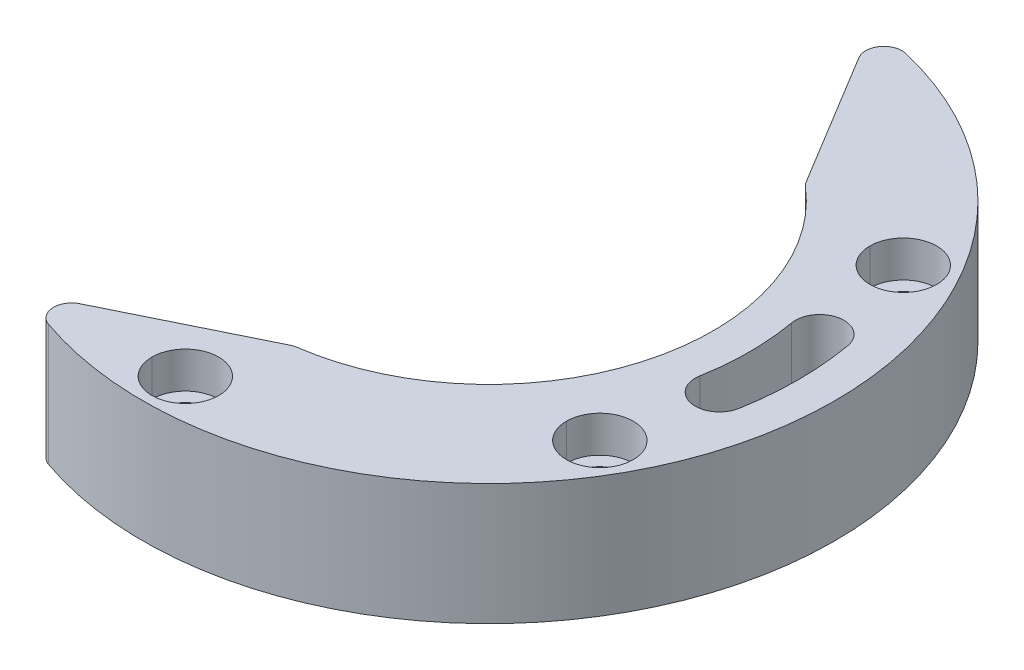
ISO-10303-21;
HEADER;
FILE_DESCRIPTION(('STEP AP214'),'2;1');
FILE_NAME('part.step','',(''),(''),'','','');
FILE_SCHEMA(('AUTOMOTIVE_DESIGN { 1 0 10303 214 1 1 1 1 }'));
ENDSEC;
DATA;
#1=APPLICATION_CONTEXT('core data for automotive mechanical design processes');
#2=APPLICATION_PROTOCOL_DEFINITION('international standard','automotive_design',2000,#1);
#3=PRODUCT_CONTEXT('',#1,'mechanical');
#4=PRODUCT('Part','Part','',(#3));
#5=PRODUCT_RELATED_PRODUCT_CATEGORY('part','',(#4));
#6=PRODUCT_DEFINITION_FORMATION('','',#4);
#7=PRODUCT_DEFINITION_CONTEXT('part definition',#1,'design');
#8=PRODUCT_DEFINITION('design','',#6,#7);
#9=PRODUCT_DEFINITION_SHAPE('','',#8);
#10=(LENGTH_UNIT() NAMED_UNIT(*) SI_UNIT(.MILLI.,.METRE.));
#11=(NAMED_UNIT(*) PLANE_ANGLE_UNIT() SI_UNIT($,.RADIAN.));
#12=(NAMED_UNIT(*) SI_UNIT($,.STERADIAN.) SOLID_ANGLE_UNIT());
#13=UNCERTAINTY_MEASURE_WITH_UNIT(LENGTH_MEASURE(1.E-05),#10,'distance_accuracy_value','');
#14=(GEOMETRIC_REPRESENTATION_CONTEXT(3) GLOBAL_UNCERTAINTY_ASSIGNED_CONTEXT((#13)) GLOBAL_UNIT_ASSIGNED_CONTEXT((#10,
#11,#12)) REPRESENTATION_CONTEXT('',''));
#15=CARTESIAN_POINT('',(0.,0.,0.));
#16=DIRECTION('',(0.,0.,1.));
#17=DIRECTION('',(1.,0.,0.));
#18=AXIS2_PLACEMENT_3D('',#15,#16,#17);
#19=CARTESIAN_POINT('',(23.1345391558331,18.036,-4.1283287232515));
#20=DIRECTION('',(0.,-1.,0.));
#21=DIRECTION('',(-0.258819045102522,0.,-0.965925826289068));
#22=AXIS2_PLACEMENT_3D('',#19,#20,#21);
#23=CYLINDRICAL_SURFACE('',#22,2.);
#24=CARTESIAN_POINT('',(23.1345391558331,5.,-4.1283287232515));
#25=DIRECTION('',(0.,1.,0.));
#26=DIRECTION('',(0.984448474716304,0.,-0.175673562691552));
#27=AXIS2_PLACEMENT_3D('',#24,#25,#26);
#28=CIRCLE('',#27,2.);
#29=CARTESIAN_POINT('',(25.1034361052657,5.,-4.4796758486346));
#30=VERTEX_POINT('',#29);
#31=CARTESIAN_POINT('',(21.1656422064005,5.,-3.77698159786839));
#32=VERTEX_POINT('',#31);
#33=EDGE_CURVE('E10',#30,#32,#28,.T.);
#34=ORIENTED_EDGE('',*,*,#33,.T.);
#35=DIRECTION('',(0.,-1.,0.));
#36=VECTOR('',#35,1.);
#37=CARTESIAN_POINT('',(21.1656422064005,5.,-3.77698159786839));
#38=LINE('',#37,#36);
#39=CARTESIAN_POINT('',(21.1656422064005,-5.,-3.77698159786839));
#40=VERTEX_POINT('',#39);
#41=EDGE_CURVE('E24',#32,#40,#38,.T.);
#42=ORIENTED_EDGE('',*,*,#41,.T.);
#43=CARTESIAN_POINT('',(23.1345391558331,-5.,-4.1283287232515));
#44=DIRECTION('',(0.,-1.,0.));
#45=DIRECTION('',(-0.984448474716304,0.,0.175673562691554));
#46=AXIS2_PLACEMENT_3D('',#43,#44,#45);
#47=CIRCLE('',#46,2.);
#48=CARTESIAN_POINT('',(25.1034361052657,-5.,-4.4796758486346));
#49=VERTEX_POINT('',#48);
#50=EDGE_CURVE('E429',#40,#49,#47,.T.);
#51=ORIENTED_EDGE('',*,*,#50,.T.);
#52=DIRECTION('',(0.,-1.,0.));
#53=VECTOR('',#52,1.);
#54=CARTESIAN_POINT('',(25.1034361052657,5.,-4.4796758486346));
#55=LINE('',#54,#53);
#56=EDGE_CURVE('E425',#30,#49,#55,.T.);
#57=ORIENTED_EDGE('',*,*,#56,.F.);
#58=EDGE_LOOP('',(#34,#42,#51,#57));
#59=FACE_BOUND('',#58,.T.);
#60=ADVANCED_FACE('F16',(#59),#23,.F.);
#61=CARTESIAN_POINT('',(0.,5.,0.));
#62=DIRECTION('',(0.,1.,0.));
#63=DIRECTION('',(-1.,0.,0.));
#64=AXIS2_PLACEMENT_3D('',#61,#62,#63);
#65=CYLINDRICAL_SURFACE('',#64,21.5);
#66=CARTESIAN_POINT('',(0.,-5.,0.));
#67=DIRECTION('',(0.,1.,0.));
#68=DIRECTION('',(0.984448474716304,0.,0.175673562691553));
#69=AXIS2_PLACEMENT_3D('',#66,#67,#68);
#70=CIRCLE('',#69,21.5);
#71=CARTESIAN_POINT('',(21.1656422064005,-5.,3.77698159786839));
#72=VERTEX_POINT('',#71);
#73=EDGE_CURVE('E422',#72,#40,#70,.T.);
#74=ORIENTED_EDGE('',*,*,#73,.T.);
#75=ORIENTED_EDGE('',*,*,#41,.F.);
#76=CARTESIAN_POINT('',(0.,5.,0.));
#77=DIRECTION('',(0.,1.,0.));
#78=DIRECTION('',(0.984448474716304,0.,0.175673562691553));
#79=AXIS2_PLACEMENT_3D('',#76,#77,#78);
#80=CIRCLE('',#79,21.5);
#81=CARTESIAN_POINT('',(21.1656422064005,5.,3.77698159786839));
#82=VERTEX_POINT('',#81);
#83=EDGE_CURVE('E418',#82,#32,#80,.T.);
#84=ORIENTED_EDGE('',*,*,#83,.F.);
#85=DIRECTION('',(0.,-1.,0.));
#86=VECTOR('',#85,1.);
#87=CARTESIAN_POINT('',(21.1656422064005,5.,3.77698159786839));
#88=LINE('',#87,#86);
#89=EDGE_CURVE('E415',#82,#72,#88,.T.);
#90=ORIENTED_EDGE('',*,*,#89,.T.);
#91=EDGE_LOOP('',(#74,#75,#84,#90));
#92=FACE_BOUND('',#91,.T.);
#93=ADVANCED_FACE('F452',(#92),#65,.T.);
#94=CARTESIAN_POINT('',(23.1345391558331,18.036,4.1283287232515));
#95=DIRECTION('',(0.,-1.,0.));
#96=DIRECTION('',(-0.25881904510252,0.,0.965925826289069));
#97=AXIS2_PLACEMENT_3D('',#94,#95,#96);
#98=CYLINDRICAL_SURFACE('',#97,2.);
#99=CARTESIAN_POINT('',(23.1345391558331,5.,4.1283287232515));
#100=DIRECTION('',(0.,1.,0.));
#101=DIRECTION('',(-0.984448474716304,0.,-0.175673562691552));
#102=AXIS2_PLACEMENT_3D('',#99,#100,#101);
#103=CIRCLE('',#102,2.);
#104=CARTESIAN_POINT('',(25.1034361052657,5.,4.47967584863461));
#105=VERTEX_POINT('',#104);
#106=EDGE_CURVE('E412',#82,#105,#103,.T.);
#107=ORIENTED_EDGE('',*,*,#106,.T.);
#108=DIRECTION('',(0.,-1.,0.));
#109=VECTOR('',#108,1.);
#110=CARTESIAN_POINT('',(25.1034361052657,5.,4.47967584863461));
#111=LINE('',#110,#109);
#112=CARTESIAN_POINT('',(25.1034361052657,-5.,4.47967584863461));
#113=VERTEX_POINT('',#112);
#114=EDGE_CURVE('E409',#105,#113,#111,.T.);
#115=ORIENTED_EDGE('',*,*,#114,.T.);
#116=CARTESIAN_POINT('',(23.1345391558331,-5.,4.1283287232515));
#117=DIRECTION('',(0.,-1.,0.));
#118=DIRECTION('',(0.984448474716303,0.,0.175673562691555));
#119=AXIS2_PLACEMENT_3D('',#116,#117,#118);
#120=CIRCLE('',#119,2.);
#121=EDGE_CURVE('E405',#113,#72,#120,.T.);
#122=ORIENTED_EDGE('',*,*,#121,.T.);
#123=ORIENTED_EDGE('',*,*,#89,.F.);
#124=EDGE_LOOP('',(#107,#115,#122,#123));
#125=FACE_BOUND('',#124,.T.);
#126=ADVANCED_FACE('F447',(#125),#98,.F.);
#127=CARTESIAN_POINT('',(0.,5.,0.));
#128=DIRECTION('',(0.,1.,0.));
#129=DIRECTION('',(-1.,0.,0.));
#130=AXIS2_PLACEMENT_3D('',#127,#128,#129);
#131=CYLINDRICAL_SURFACE('',#130,25.5);
#132=CARTESIAN_POINT('',(0.,5.,0.));
#133=DIRECTION('',(0.,1.,0.));
#134=DIRECTION('',(0.984448474716304,0.,0.175673562691553));
#135=AXIS2_PLACEMENT_3D('',#132,#133,#134);
#136=CIRCLE('',#135,25.5);
#137=EDGE_CURVE('E401',#105,#30,#136,.T.);
#138=ORIENTED_EDGE('',*,*,#137,.T.);
#139=ORIENTED_EDGE('',*,*,#56,.T.);
#140=CARTESIAN_POINT('',(0.,-5.,0.));
#141=DIRECTION('',(0.,1.,0.));
#142=DIRECTION('',(0.984448474716304,0.,0.175673562691553));
#143=AXIS2_PLACEMENT_3D('',#140,#141,#142);
#144=CIRCLE('',#143,25.5);
#145=EDGE_CURVE('E397',#113,#49,#144,.T.);
#146=ORIENTED_EDGE('',*,*,#145,.F.);
#147=ORIENTED_EDGE('',*,*,#114,.F.);
#148=EDGE_LOOP('',(#138,#139,#146,#147));
#149=FACE_BOUND('',#148,.T.);
#150=ADVANCED_FACE('F439',(#149),#131,.F.);
#151=CARTESIAN_POINT('',(21.650635094611,-5.,-12.5));
#152=DIRECTION('',(0.,-1.,0.));
#153=DIRECTION('',(1.,0.,0.));
#154=AXIS2_PLACEMENT_3D('',#151,#152,#153);
#155=CYLINDRICAL_SURFACE('',#154,1.6);
#156=DIRECTION('',(0.,1.,0.));
#157=VECTOR('',#156,1.);
#158=CARTESIAN_POINT('',(20.050635094611,-5.,-12.5));
#159=LINE('',#158,#157);
#160=CARTESIAN_POINT('',(20.050635094611,-5.,-12.5));
#161=VERTEX_POINT('',#160);
#162=CARTESIAN_POINT('',(20.050635094611,2.,-12.5));
#163=VERTEX_POINT('',#162);
#164=EDGE_CURVE('E393',#161,#163,#159,.T.);
#165=ORIENTED_EDGE('',*,*,#164,.F.);
#166=CARTESIAN_POINT('',(21.650635094611,-5.,-12.5));
#167=DIRECTION('',(0.,-1.,0.));
#168=DIRECTION('',(-1.,0.,0.));
#169=AXIS2_PLACEMENT_3D('',#166,#167,#168);
#170=CIRCLE('',#169,1.6);
#171=CARTESIAN_POINT('',(23.250635094611,-5.,-12.5));
#172=VERTEX_POINT('',#171);
#173=EDGE_CURVE('E390',#161,#172,#170,.T.);
#174=ORIENTED_EDGE('',*,*,#173,.T.);
#175=DIRECTION('',(0.,1.,0.));
#176=VECTOR('',#175,1.);
#177=CARTESIAN_POINT('',(23.250635094611,-5.,-12.5));
#178=LINE('',#177,#176);
#179=CARTESIAN_POINT('',(23.250635094611,2.,-12.5));
#180=VERTEX_POINT('',#179);
#181=EDGE_CURVE('E387',#172,#180,#178,.T.);
#182=ORIENTED_EDGE('',*,*,#181,.T.);
#183=CARTESIAN_POINT('',(21.650635094611,2.,-12.5));
#184=DIRECTION('',(0.,1.,0.));
#185=DIRECTION('',(1.,0.,0.));
#186=AXIS2_PLACEMENT_3D('',#183,#184,#185);
#187=CIRCLE('',#186,1.6);
#188=EDGE_CURVE('E384',#180,#163,#187,.T.);
#189=ORIENTED_EDGE('',*,*,#188,.T.);
#190=EDGE_LOOP('',(#165,#174,#182,#189));
#191=FACE_BOUND('',#190,.T.);
#192=ADVANCED_FACE('F463',(#191),#155,.F.);
#193=CARTESIAN_POINT('',(21.650635094611,5.,-12.5));
#194=DIRECTION('',(0.,1.,0.));
#195=DIRECTION('',(-1.,0.,0.));
#196=AXIS2_PLACEMENT_3D('',#193,#194,#195);
#197=CYLINDRICAL_SURFACE('',#196,2.75);
#198=CARTESIAN_POINT('',(21.650635094611,2.,-12.5));
#199=DIRECTION('',(0.,1.,0.));
#200=DIRECTION('',(1.,0.,0.));
#201=AXIS2_PLACEMENT_3D('',#198,#199,#200);
#202=CIRCLE('',#201,2.75);
#203=CARTESIAN_POINT('',(24.400635094611,2.,-12.5));
#204=VERTEX_POINT('',#203);
#205=CARTESIAN_POINT('',(18.900635094611,2.,-12.5));
#206=VERTEX_POINT('',#205);
#207=EDGE_CURVE('E380',#204,#206,#202,.T.);
#208=ORIENTED_EDGE('',*,*,#207,.F.);
#209=DIRECTION('',(0.,-1.,0.));
#210=VECTOR('',#209,1.);
#211=CARTESIAN_POINT('',(24.400635094611,5.,-12.5));
#212=LINE('',#211,#210);
#213=CARTESIAN_POINT('',(24.400635094611,5.,-12.5));
#214=VERTEX_POINT('',#213);
#215=EDGE_CURVE('E376',#214,#204,#212,.T.);
#216=ORIENTED_EDGE('',*,*,#215,.F.);
#217=CARTESIAN_POINT('',(21.650635094611,5.,-12.5));
#218=DIRECTION('',(0.,1.,0.));
#219=DIRECTION('',(1.,0.,0.));
#220=AXIS2_PLACEMENT_3D('',#217,#218,#219);
#221=CIRCLE('',#220,2.75);
#222=CARTESIAN_POINT('',(18.900635094611,5.,-12.5));
#223=VERTEX_POINT('',#222);
#224=EDGE_CURVE('E373',#214,#223,#221,.T.);
#225=ORIENTED_EDGE('',*,*,#224,.T.);
#226=DIRECTION('',(0.,-1.,0.));
#227=VECTOR('',#226,1.);
#228=CARTESIAN_POINT('',(18.900635094611,5.,-12.5));
#229=LINE('',#228,#227);
#230=EDGE_CURVE('E370',#223,#206,#229,.T.);
#231=ORIENTED_EDGE('',*,*,#230,.T.);
#232=EDGE_LOOP('',(#208,#216,#225,#231));
#233=FACE_BOUND('',#232,.T.);
#234=ADVANCED_FACE('F466',(#233),#197,.F.);
#235=CARTESIAN_POINT('',(21.650635094611,5.,-12.5));
#236=DIRECTION('',(0.,1.,0.));
#237=DIRECTION('',(-1.,0.,0.));
#238=AXIS2_PLACEMENT_3D('',#235,#236,#237);
#239=CYLINDRICAL_SURFACE('',#238,2.75);
#240=CARTESIAN_POINT('',(21.650635094611,5.,-12.5));
#241=DIRECTION('',(0.,1.,0.));
#242=DIRECTION('',(-1.,0.,0.));
#243=AXIS2_PLACEMENT_3D('',#240,#241,#242);
#244=CIRCLE('',#243,2.75);
#245=EDGE_CURVE('E366',#223,#214,#244,.T.);
#246=ORIENTED_EDGE('',*,*,#245,.T.);
#247=ORIENTED_EDGE('',*,*,#215,.T.);
#248=CARTESIAN_POINT('',(21.650635094611,2.,-12.5));
#249=DIRECTION('',(0.,1.,0.));
#250=DIRECTION('',(-1.,0.,0.));
#251=AXIS2_PLACEMENT_3D('',#248,#249,#250);
#252=CIRCLE('',#251,2.75);
#253=EDGE_CURVE('E362',#206,#204,#252,.T.);
#254=ORIENTED_EDGE('',*,*,#253,.F.);
#255=ORIENTED_EDGE('',*,*,#230,.F.);
#256=EDGE_LOOP('',(#246,#247,#254,#255));
#257=FACE_BOUND('',#256,.T.);
#258=ADVANCED_FACE('F470',(#257),#239,.F.);
#259=CARTESIAN_POINT('',(0.,2.,0.));
#260=DIRECTION('',(0.,1.,0.));
#261=DIRECTION('',(-1.,0.,0.));
#262=AXIS2_PLACEMENT_3D('',#259,#260,#261);
#263=PLANE('',#262);
#264=ORIENTED_EDGE('',*,*,#188,.F.);
#265=CARTESIAN_POINT('',(21.650635094611,2.,-12.5));
#266=DIRECTION('',(0.,1.,0.));
#267=DIRECTION('',(-1.,0.,0.));
#268=AXIS2_PLACEMENT_3D('',#265,#266,#267);
#269=CIRCLE('',#268,1.6);
#270=EDGE_CURVE('E358',#163,#180,#269,.T.);
#271=ORIENTED_EDGE('',*,*,#270,.F.);
#272=EDGE_LOOP('',(#264,#271));
#273=FACE_BOUND('',#272,.T.);
#274=ORIENTED_EDGE('',*,*,#207,.T.);
#275=ORIENTED_EDGE('',*,*,#253,.T.);
#276=EDGE_LOOP('',(#274,#275));
#277=FACE_BOUND('',#276,.T.);
#278=ADVANCED_FACE('F474',(#273,#277),#263,.T.);
#279=CARTESIAN_POINT('',(21.650635094611,-5.,-12.5));
#280=DIRECTION('',(0.,-1.,0.));
#281=DIRECTION('',(1.,0.,0.));
#282=AXIS2_PLACEMENT_3D('',#279,#280,#281);
#283=CYLINDRICAL_SURFACE('',#282,1.6);
#284=ORIENTED_EDGE('',*,*,#181,.F.);
#285=CARTESIAN_POINT('',(21.650635094611,-5.,-12.5));
#286=DIRECTION('',(0.,-1.,0.));
#287=DIRECTION('',(1.,0.,0.));
#288=AXIS2_PLACEMENT_3D('',#285,#286,#287);
#289=CIRCLE('',#288,1.6);
#290=EDGE_CURVE('E354',#172,#161,#289,.T.);
#291=ORIENTED_EDGE('',*,*,#290,.T.);
#292=ORIENTED_EDGE('',*,*,#164,.T.);
#293=ORIENTED_EDGE('',*,*,#270,.T.);
#294=EDGE_LOOP('',(#284,#291,#292,#293));
#295=FACE_BOUND('',#294,.T.);
#296=ADVANCED_FACE('F478',(#295),#283,.F.);
#297=CARTESIAN_POINT('',(21.650635094611,-5.,12.5));
#298=DIRECTION('',(0.,-1.,0.));
#299=DIRECTION('',(1.,0.,0.));
#300=AXIS2_PLACEMENT_3D('',#297,#298,#299);
#301=CYLINDRICAL_SURFACE('',#300,1.6);
#302=DIRECTION('',(0.,1.,0.));
#303=VECTOR('',#302,1.);
#304=CARTESIAN_POINT('',(20.050635094611,-5.,12.5));
#305=LINE('',#304,#303);
#306=CARTESIAN_POINT('',(20.050635094611,-5.,12.5));
#307=VERTEX_POINT('',#306);
#308=CARTESIAN_POINT('',(20.050635094611,2.,12.5));
#309=VERTEX_POINT('',#308);
#310=EDGE_CURVE('E350',#307,#309,#305,.T.);
#311=ORIENTED_EDGE('',*,*,#310,.F.);
#312=CARTESIAN_POINT('',(21.650635094611,-5.,12.5));
#313=DIRECTION('',(0.,-1.,0.));
#314=DIRECTION('',(-1.,0.,0.));
#315=AXIS2_PLACEMENT_3D('',#312,#313,#314);
#316=CIRCLE('',#315,1.6);
#317=CARTESIAN_POINT('',(23.250635094611,-5.,12.5));
#318=VERTEX_POINT('',#317);
#319=EDGE_CURVE('E347',#307,#318,#316,.T.);
#320=ORIENTED_EDGE('',*,*,#319,.T.);
#321=DIRECTION('',(0.,1.,0.));
#322=VECTOR('',#321,1.);
#323=CARTESIAN_POINT('',(23.250635094611,-5.,12.5));
#324=LINE('',#323,#322);
#325=CARTESIAN_POINT('',(23.250635094611,2.,12.5));
#326=VERTEX_POINT('',#325);
#327=EDGE_CURVE('E344',#318,#326,#324,.T.);
#328=ORIENTED_EDGE('',*,*,#327,.T.);
#329=CARTESIAN_POINT('',(21.650635094611,2.,12.5));
#330=DIRECTION('',(0.,1.,0.));
#331=DIRECTION('',(1.,0.,0.));
#332=AXIS2_PLACEMENT_3D('',#329,#330,#331);
#333=CIRCLE('',#332,1.6);
#334=EDGE_CURVE('E341',#326,#309,#333,.T.);
#335=ORIENTED_EDGE('',*,*,#334,.T.);
#336=EDGE_LOOP('',(#311,#320,#328,#335));
#337=FACE_BOUND('',#336,.T.);
#338=ADVANCED_FACE('F482',(#337),#301,.F.);
#339=CARTESIAN_POINT('',(21.650635094611,5.,12.5));
#340=DIRECTION('',(0.,1.,0.));
#341=DIRECTION('',(-1.,0.,0.));
#342=AXIS2_PLACEMENT_3D('',#339,#340,#341);
#343=CYLINDRICAL_SURFACE('',#342,2.75);
#344=CARTESIAN_POINT('',(21.650635094611,2.,12.5));
#345=DIRECTION('',(0.,1.,0.));
#346=DIRECTION('',(1.,0.,0.));
#347=AXIS2_PLACEMENT_3D('',#344,#345,#346);
#348=CIRCLE('',#347,2.75);
#349=CARTESIAN_POINT('',(24.400635094611,2.,12.5));
#350=VERTEX_POINT('',#349);
#351=CARTESIAN_POINT('',(18.900635094611,2.,12.5));
#352=VERTEX_POINT('',#351);
#353=EDGE_CURVE('E337',#350,#352,#348,.T.);
#354=ORIENTED_EDGE('',*,*,#353,.F.);
#355=DIRECTION('',(0.,-1.,0.));
#356=VECTOR('',#355,1.);
#357=CARTESIAN_POINT('',(24.400635094611,5.,12.5));
#358=LINE('',#357,#356);
#359=CARTESIAN_POINT('',(24.400635094611,5.,12.5));
#360=VERTEX_POINT('',#359);
#361=EDGE_CURVE('E333',#360,#350,#358,.T.);
#362=ORIENTED_EDGE('',*,*,#361,.F.);
#363=CARTESIAN_POINT('',(21.650635094611,5.,12.5));
#364=DIRECTION('',(0.,1.,0.));
#365=DIRECTION('',(1.,0.,0.));
#366=AXIS2_PLACEMENT_3D('',#363,#364,#365);
#367=CIRCLE('',#366,2.75);
#368=CARTESIAN_POINT('',(18.900635094611,5.,12.5));
#369=VERTEX_POINT('',#368);
#370=EDGE_CURVE('E330',#360,#369,#367,.T.);
#371=ORIENTED_EDGE('',*,*,#370,.T.);
#372=DIRECTION('',(0.,-1.,0.));
#373=VECTOR('',#372,1.);
#374=CARTESIAN_POINT('',(18.900635094611,5.,12.5));
#375=LINE('',#374,#373);
#376=EDGE_CURVE('E327',#369,#352,#375,.T.);
#377=ORIENTED_EDGE('',*,*,#376,.T.);
#378=EDGE_LOOP('',(#354,#362,#371,#377));
#379=FACE_BOUND('',#378,.T.);
#380=ADVANCED_FACE('F486',(#379),#343,.F.);
#381=CARTESIAN_POINT('',(21.650635094611,5.,12.5));
#382=DIRECTION('',(0.,1.,0.));
#383=DIRECTION('',(-1.,0.,0.));
#384=AXIS2_PLACEMENT_3D('',#381,#382,#383);
#385=CYLINDRICAL_SURFACE('',#384,2.75);
#386=CARTESIAN_POINT('',(21.650635094611,5.,12.5));
#387=DIRECTION('',(0.,1.,0.));
#388=DIRECTION('',(-1.,0.,0.));
#389=AXIS2_PLACEMENT_3D('',#386,#387,#388);
#390=CIRCLE('',#389,2.75);
#391=EDGE_CURVE('E323',#369,#360,#390,.T.);
#392=ORIENTED_EDGE('',*,*,#391,.T.);
#393=ORIENTED_EDGE('',*,*,#361,.T.);
#394=CARTESIAN_POINT('',(21.650635094611,2.,12.5));
#395=DIRECTION('',(0.,1.,0.));
#396=DIRECTION('',(-1.,0.,0.));
#397=AXIS2_PLACEMENT_3D('',#394,#395,#396);
#398=CIRCLE('',#397,2.75);
#399=EDGE_CURVE('E319',#352,#350,#398,.T.);
#400=ORIENTED_EDGE('',*,*,#399,.F.);
#401=ORIENTED_EDGE('',*,*,#376,.F.);
#402=EDGE_LOOP('',(#392,#393,#400,#401));
#403=FACE_BOUND('',#402,.T.);
#404=ADVANCED_FACE('F490',(#403),#385,.F.);
#405=CARTESIAN_POINT('',(0.,2.,0.));
#406=DIRECTION('',(0.,1.,0.));
#407=DIRECTION('',(-1.,0.,0.));
#408=AXIS2_PLACEMENT_3D('',#405,#406,#407);
#409=PLANE('',#408);
#410=ORIENTED_EDGE('',*,*,#334,.F.);
#411=CARTESIAN_POINT('',(21.650635094611,2.,12.5));
#412=DIRECTION('',(0.,1.,0.));
#413=DIRECTION('',(-1.,0.,0.));
#414=AXIS2_PLACEMENT_3D('',#411,#412,#413);
#415=CIRCLE('',#414,1.6);
#416=EDGE_CURVE('E315',#309,#326,#415,.T.);
#417=ORIENTED_EDGE('',*,*,#416,.F.);
#418=EDGE_LOOP('',(#410,#417));
#419=FACE_BOUND('',#418,.T.);
#420=ORIENTED_EDGE('',*,*,#353,.T.);
#421=ORIENTED_EDGE('',*,*,#399,.T.);
#422=EDGE_LOOP('',(#420,#421));
#423=FACE_BOUND('',#422,.T.);
#424=ADVANCED_FACE('F494',(#419,#423),#409,.T.);
#425=CARTESIAN_POINT('',(21.650635094611,-5.,12.5));
#426=DIRECTION('',(0.,-1.,0.));
#427=DIRECTION('',(1.,0.,0.));
#428=AXIS2_PLACEMENT_3D('',#425,#426,#427);
#429=CYLINDRICAL_SURFACE('',#428,1.6);
#430=ORIENTED_EDGE('',*,*,#327,.F.);
#431=CARTESIAN_POINT('',(21.650635094611,-5.,12.5));
#432=DIRECTION('',(0.,-1.,0.));
#433=DIRECTION('',(1.,0.,0.));
#434=AXIS2_PLACEMENT_3D('',#431,#432,#433);
#435=CIRCLE('',#434,1.6);
#436=EDGE_CURVE('E311',#318,#307,#435,.T.);
#437=ORIENTED_EDGE('',*,*,#436,.T.);
#438=ORIENTED_EDGE('',*,*,#310,.T.);
#439=ORIENTED_EDGE('',*,*,#416,.T.);
#440=EDGE_LOOP('',(#430,#437,#438,#439));
#441=FACE_BOUND('',#440,.T.);
#442=ADVANCED_FACE('F498',(#441),#429,.F.);
#443=CARTESIAN_POINT('',(0.,-5.,25.));
#444=DIRECTION('',(0.,-1.,0.));
#445=DIRECTION('',(1.,0.,0.));
#446=AXIS2_PLACEMENT_3D('',#443,#444,#445);
#447=CYLINDRICAL_SURFACE('',#446,1.6);
#448=DIRECTION('',(0.,1.,0.));
#449=VECTOR('',#448,1.);
#450=CARTESIAN_POINT('',(-1.6,-5.,25.));
#451=LINE('',#450,#449);
#452=CARTESIAN_POINT('',(-1.6,-5.,25.));
#453=VERTEX_POINT('',#452);
#454=CARTESIAN_POINT('',(-1.6,2.,25.));
#455=VERTEX_POINT('',#454);
#456=EDGE_CURVE('E307',#453,#455,#451,.T.);
#457=ORIENTED_EDGE('',*,*,#456,.F.);
#458=CARTESIAN_POINT('',(0.,-5.,25.));
#459=DIRECTION('',(0.,-1.,0.));
#460=DIRECTION('',(-1.,0.,0.));
#461=AXIS2_PLACEMENT_3D('',#458,#459,#460);
#462=CIRCLE('',#461,1.6);
#463=CARTESIAN_POINT('',(1.6,-5.,25.));
#464=VERTEX_POINT('',#463);
#465=EDGE_CURVE('E304',#453,#464,#462,.T.);
#466=ORIENTED_EDGE('',*,*,#465,.T.);
#467=DIRECTION('',(0.,1.,0.));
#468=VECTOR('',#467,1.);
#469=CARTESIAN_POINT('',(1.6,-5.,25.));
#470=LINE('',#469,#468);
#471=CARTESIAN_POINT('',(1.6,2.,25.));
#472=VERTEX_POINT('',#471);
#473=EDGE_CURVE('E301',#464,#472,#470,.T.);
#474=ORIENTED_EDGE('',*,*,#473,.T.);
#475=CARTESIAN_POINT('',(0.,2.,25.));
#476=DIRECTION('',(0.,1.,0.));
#477=DIRECTION('',(1.,0.,0.));
#478=AXIS2_PLACEMENT_3D('',#475,#476,#477);
#479=CIRCLE('',#478,1.6);
#480=EDGE_CURVE('E298',#472,#455,#479,.T.);
#481=ORIENTED_EDGE('',*,*,#480,.T.);
#482=EDGE_LOOP('',(#457,#466,#474,#481));
#483=FACE_BOUND('',#482,.T.);
#484=ADVANCED_FACE('F502',(#483),#447,.F.);
#485=CARTESIAN_POINT('',(0.,5.,25.));
#486=DIRECTION('',(0.,1.,0.));
#487=DIRECTION('',(-1.,0.,0.));
#488=AXIS2_PLACEMENT_3D('',#485,#486,#487);
#489=CYLINDRICAL_SURFACE('',#488,2.75);
#490=CARTESIAN_POINT('',(0.,2.,25.));
#491=DIRECTION('',(0.,1.,0.));
#492=DIRECTION('',(1.,0.,0.));
#493=AXIS2_PLACEMENT_3D('',#490,#491,#492);
#494=CIRCLE('',#493,2.75);
#495=CARTESIAN_POINT('',(2.75,2.,25.));
#496=VERTEX_POINT('',#495);
#497=CARTESIAN_POINT('',(-2.75,2.,25.));
#498=VERTEX_POINT('',#497);
#499=EDGE_CURVE('E294',#496,#498,#494,.T.);
#500=ORIENTED_EDGE('',*,*,#499,.F.);
#501=DIRECTION('',(0.,-1.,0.));
#502=VECTOR('',#501,1.);
#503=CARTESIAN_POINT('',(2.75,5.,25.));
#504=LINE('',#503,#502);
#505=CARTESIAN_POINT('',(2.75,5.,25.));
#506=VERTEX_POINT('',#505);
#507=EDGE_CURVE('E290',#506,#496,#504,.T.);
#508=ORIENTED_EDGE('',*,*,#507,.F.);
#509=CARTESIAN_POINT('',(0.,5.,25.));
#510=DIRECTION('',(0.,1.,0.));
#511=DIRECTION('',(1.,0.,0.));
#512=AXIS2_PLACEMENT_3D('',#509,#510,#511);
#513=CIRCLE('',#512,2.75);
#514=CARTESIAN_POINT('',(-2.75,5.,25.));
#515=VERTEX_POINT('',#514);
#516=EDGE_CURVE('E287',#506,#515,#513,.T.);
#517=ORIENTED_EDGE('',*,*,#516,.T.);
#518=DIRECTION('',(0.,-1.,0.));
#519=VECTOR('',#518,1.);
#520=CARTESIAN_POINT('',(-2.75,5.,25.));
#521=LINE('',#520,#519);
#522=EDGE_CURVE('E284',#515,#498,#521,.T.);
#523=ORIENTED_EDGE('',*,*,#522,.T.);
#524=EDGE_LOOP('',(#500,#508,#517,#523));
#525=FACE_BOUND('',#524,.T.);
#526=ADVANCED_FACE('F506',(#525),#489,.F.);
#527=CARTESIAN_POINT('',(0.,5.,25.));
#528=DIRECTION('',(0.,1.,0.));
#529=DIRECTION('',(-1.,0.,0.));
#530=AXIS2_PLACEMENT_3D('',#527,#528,#529);
#531=CYLINDRICAL_SURFACE('',#530,2.75);
#532=CARTESIAN_POINT('',(0.,5.,25.));
#533=DIRECTION('',(0.,1.,0.));
#534=DIRECTION('',(-1.,0.,0.));
#535=AXIS2_PLACEMENT_3D('',#532,#533,#534);
#536=CIRCLE('',#535,2.75);
#537=EDGE_CURVE('E280',#515,#506,#536,.T.);
#538=ORIENTED_EDGE('',*,*,#537,.T.);
#539=ORIENTED_EDGE('',*,*,#507,.T.);
#540=CARTESIAN_POINT('',(0.,2.,25.));
#541=DIRECTION('',(0.,1.,0.));
#542=DIRECTION('',(-1.,0.,0.));
#543=AXIS2_PLACEMENT_3D('',#540,#541,#542);
#544=CIRCLE('',#543,2.75);
#545=EDGE_CURVE('E276',#498,#496,#544,.T.);
#546=ORIENTED_EDGE('',*,*,#545,.F.);
#547=ORIENTED_EDGE('',*,*,#522,.F.);
#548=EDGE_LOOP('',(#538,#539,#546,#547));
#549=FACE_BOUND('',#548,.T.);
#550=ADVANCED_FACE('F510',(#549),#531,.F.);
#551=CARTESIAN_POINT('',(0.,2.,0.));
#552=DIRECTION('',(0.,1.,0.));
#553=DIRECTION('',(-1.,0.,0.));
#554=AXIS2_PLACEMENT_3D('',#551,#552,#553);
#555=PLANE('',#554);
#556=ORIENTED_EDGE('',*,*,#480,.F.);
#557=CARTESIAN_POINT('',(0.,2.,25.));
#558=DIRECTION('',(0.,1.,0.));
#559=DIRECTION('',(-1.,0.,0.));
#560=AXIS2_PLACEMENT_3D('',#557,#558,#559);
#561=CIRCLE('',#560,1.6);
#562=EDGE_CURVE('E272',#455,#472,#561,.T.);
#563=ORIENTED_EDGE('',*,*,#562,.F.);
#564=EDGE_LOOP('',(#556,#563));
#565=FACE_BOUND('',#564,.T.);
#566=ORIENTED_EDGE('',*,*,#499,.T.);
#567=ORIENTED_EDGE('',*,*,#545,.T.);
#568=EDGE_LOOP('',(#566,#567));
#569=FACE_BOUND('',#568,.T.);
#570=ADVANCED_FACE('F514',(#565,#569),#555,.T.);
#571=CARTESIAN_POINT('',(0.,-5.,25.));
#572=DIRECTION('',(0.,-1.,0.));
#573=DIRECTION('',(1.,0.,0.));
#574=AXIS2_PLACEMENT_3D('',#571,#572,#573);
#575=CYLINDRICAL_SURFACE('',#574,1.6);
#576=ORIENTED_EDGE('',*,*,#473,.F.);
#577=CARTESIAN_POINT('',(0.,-5.,25.));
#578=DIRECTION('',(0.,-1.,0.));
#579=DIRECTION('',(1.,0.,0.));
#580=AXIS2_PLACEMENT_3D('',#577,#578,#579);
#581=CIRCLE('',#580,1.6);
#582=EDGE_CURVE('E268',#464,#453,#581,.T.);
#583=ORIENTED_EDGE('',*,*,#582,.T.);
#584=ORIENTED_EDGE('',*,*,#456,.T.);
#585=ORIENTED_EDGE('',*,*,#562,.T.);
#586=EDGE_LOOP('',(#576,#583,#584,#585));
#587=FACE_BOUND('',#586,.T.);
#588=ADVANCED_FACE('F518',(#587),#575,.F.);
#589=CARTESIAN_POINT('',(0.,-5.,0.));
#590=DIRECTION('',(0.,-1.,0.));
#591=DIRECTION('',(1.,0.,0.));
#592=AXIS2_PLACEMENT_3D('',#589,#590,#591);
#593=PLANE('',#592);
#594=ORIENTED_EDGE('',*,*,#50,.F.);
#595=ORIENTED_EDGE('',*,*,#73,.F.);
#596=ORIENTED_EDGE('',*,*,#121,.F.);
#597=ORIENTED_EDGE('',*,*,#145,.T.);
#598=EDGE_LOOP('',(#594,#595,#596,#597));
#599=FACE_BOUND('',#598,.T.);
#600=ORIENTED_EDGE('',*,*,#173,.F.);
#601=ORIENTED_EDGE('',*,*,#290,.F.);
#602=EDGE_LOOP('',(#600,#601));
#603=FACE_BOUND('',#602,.T.);
#604=ORIENTED_EDGE('',*,*,#319,.F.);
#605=ORIENTED_EDGE('',*,*,#436,.F.);
#606=EDGE_LOOP('',(#604,#605));
#607=FACE_BOUND('',#606,.T.);
#608=ORIENTED_EDGE('',*,*,#465,.F.);
#609=ORIENTED_EDGE('',*,*,#582,.F.);
#610=EDGE_LOOP('',(#608,#609));
#611=FACE_BOUND('',#610,.T.);
#612=CARTESIAN_POINT('',(0.,-5.,0.));
#613=DIRECTION('',(0.,-1.,0.));
#614=DIRECTION('',(0.233104454531094,0.,-0.972451702285394));
#615=AXIS2_PLACEMENT_3D('',#612,#613,#614);
#616=CIRCLE('',#615,28.5);
#617=CARTESIAN_POINT('',(6.64347695413618,-5.,-27.7148735151337));
#618=VERTEX_POINT('',#617);
#619=CARTESIAN_POINT('',(-9.34455007267337,-5.,26.9245126964129));
#620=VERTEX_POINT('',#619);
#621=EDGE_CURVE('E265',#618,#620,#616,.T.);
#622=ORIENTED_EDGE('',*,*,#621,.T.);
#623=CARTESIAN_POINT('',(-8.85273164779584,-5.,25.5074330808122));
#624=DIRECTION('',(0.,-1.,0.));
#625=DIRECTION('',(-0.327878949918358,0.,0.944719743733788));
#626=AXIS2_PLACEMENT_3D('',#623,#624,#625);
#627=CIRCLE('',#626,1.5);
#628=CARTESIAN_POINT('',(-9.51346314014744,-5.,24.1607950837934));
#629=VERTEX_POINT('',#628);
#630=EDGE_CURVE('E262',#620,#629,#627,.T.);
#631=ORIENTED_EDGE('',*,*,#630,.T.);
#632=DIRECTION('',(0.897758664679207,0.,-0.44048766156773));
#633=VECTOR('',#632,1.);
#634=CARTESIAN_POINT('',(-9.51346314014744,-5.,24.1607950837934));
#635=LINE('',#634,#633);
#636=CARTESIAN_POINT('',(2.10203301346879,-5.,18.4616211966958));
#637=VERTEX_POINT('',#636);
#638=EDGE_CURVE('E259',#629,#637,#635,.T.);
#639=ORIENTED_EDGE('',*,*,#638,.T.);
#640=CARTESIAN_POINT('',(2.76276450582038,-5.,19.8082591937146));
#641=DIRECTION('',(0.,-1.,0.));
#642=DIRECTION('',(-0.440487661567726,0.,-0.897758664679209));
#643=AXIS2_PLACEMENT_3D('',#640,#641,#642);
#644=CIRCLE('',#643,1.5);
#645=CARTESIAN_POINT('',(2.55555716788385,-5.,18.322639754186));
#646=VERTEX_POINT('',#645);
#647=EDGE_CURVE('E256',#637,#646,#644,.T.);
#648=ORIENTED_EDGE('',*,*,#647,.T.);
#649=CARTESIAN_POINT('',(0.,-5.,0.));
#650=DIRECTION('',(0.,1.,0.));
#651=DIRECTION('',(0.138138225291018,0.,0.99041295968573));
#652=AXIS2_PLACEMENT_3D('',#649,#650,#651);
#653=CIRCLE('',#652,18.5);
#654=CARTESIAN_POINT('',(12.029545081839,-5.,-14.0548939919162));
#655=VERTEX_POINT('',#654);
#656=EDGE_CURVE('E253',#646,#655,#653,.T.);
#657=ORIENTED_EDGE('',*,*,#656,.T.);
#658=CARTESIAN_POINT('',(13.0049136019881,-5.,-15.1944799912608));
#659=DIRECTION('',(0.,-1.,0.));
#660=DIRECTION('',(-0.650245680099409,0.,0.759723999563037));
#661=AXIS2_PLACEMENT_3D('',#658,#659,#660);
#662=CIRCLE('',#661,1.5);
#663=CARTESIAN_POINT('',(11.722477893601,-5.,-14.416432014685));
#664=VERTEX_POINT('',#663);
#665=EDGE_CURVE('E250',#655,#664,#662,.T.);
#666=ORIENTED_EDGE('',*,*,#665,.T.);
#667=DIRECTION('',(-0.518698651050486,0.,-0.854957138924757));
#668=VECTOR('',#667,1.);
#669=CARTESIAN_POINT('',(11.722477893601,-5.,-14.416432014685));
#670=LINE('',#669,#668);
#671=CARTESIAN_POINT('',(5.01138456395241,-5.,-25.4781479851299));
#672=VERTEX_POINT('',#671);
#673=EDGE_CURVE('E247',#664,#672,#670,.T.);
#674=ORIENTED_EDGE('',*,*,#673,.T.);
#675=CARTESIAN_POINT('',(6.29382027233955,-5.,-26.2561959617056));
#676=DIRECTION('',(0.,-1.,0.));
#677=DIRECTION('',(-0.854957138924756,0.,0.518698651050487));
#678=AXIS2_PLACEMENT_3D('',#675,#676,#677);
#679=CIRCLE('',#678,1.5);
#680=EDGE_CURVE('E193',#672,#618,#679,.T.);
#681=ORIENTED_EDGE('',*,*,#680,.T.);
#682=EDGE_LOOP('',(#622,#631,#639,#648,#657,#666,#674,#681));
#683=FACE_BOUND('',#682,.T.);
#684=ADVANCED_FACE('F443',(#599,#603,#607,#611,#683),#593,.T.);
#685=CARTESIAN_POINT('',(0.,5.,0.));
#686=DIRECTION('',(0.,-1.,0.));
#687=DIRECTION('',(1.,0.,0.));
#688=AXIS2_PLACEMENT_3D('',#685,#686,#687);
#689=CYLINDRICAL_SURFACE('',#688,28.5);
#690=CARTESIAN_POINT('',(0.,5.,0.));
#691=DIRECTION('',(0.,-1.,0.));
#692=DIRECTION('',(0.233104454531094,0.,-0.972451702285394));
#693=AXIS2_PLACEMENT_3D('',#690,#691,#692);
#694=CIRCLE('',#693,28.5);
#695=CARTESIAN_POINT('',(6.64347695413618,5.,-27.7148735151337));
#696=VERTEX_POINT('',#695);
#697=CARTESIAN_POINT('',(-9.34455007267337,5.,26.9245126964129));
#698=VERTEX_POINT('',#697);
#699=EDGE_CURVE('E198',#696,#698,#694,.T.);
#700=ORIENTED_EDGE('',*,*,#699,.T.);
#701=DIRECTION('',(0.,1.,0.));
#702=VECTOR('',#701,1.);
#703=CARTESIAN_POINT('',(-9.34455007267337,-5.,26.9245126964129));
#704=LINE('',#703,#702);
#705=EDGE_CURVE('E239',#620,#698,#704,.T.);
#706=ORIENTED_EDGE('',*,*,#705,.F.);
#707=ORIENTED_EDGE('',*,*,#621,.F.);
#708=DIRECTION('',(0.,1.,0.));
#709=VECTOR('',#708,1.);
#710=CARTESIAN_POINT('',(6.64347695413618,-5.,-27.7148735151337));
#711=LINE('',#710,#709);
#712=EDGE_CURVE('E236',#618,#696,#711,.T.);
#713=ORIENTED_EDGE('',*,*,#712,.T.);
#714=EDGE_LOOP('',(#700,#706,#707,#713));
#715=FACE_BOUND('',#714,.T.);
#716=ADVANCED_FACE('F525',(#715),#689,.T.);
#717=CARTESIAN_POINT('',(-8.85273164779584,-18.036,25.5074330808122));
#718=DIRECTION('',(0.,1.,0.));
#719=DIRECTION('',(-0.44048766156773,0.,-0.897758664679207));
#720=AXIS2_PLACEMENT_3D('',#717,#718,#719);
#721=CYLINDRICAL_SURFACE('',#720,1.5);
#722=DIRECTION('',(0.,1.,0.));
#723=VECTOR('',#722,1.);
#724=CARTESIAN_POINT('',(-9.51346314014743,-5.,24.1607950837934));
#725=LINE('',#724,#723);
#726=CARTESIAN_POINT('',(-9.51346314014744,5.,24.1607950837934));
#727=VERTEX_POINT('',#726);
#728=EDGE_CURVE('E232',#629,#727,#725,.T.);
#729=ORIENTED_EDGE('',*,*,#728,.F.);
#730=ORIENTED_EDGE('',*,*,#630,.F.);
#731=ORIENTED_EDGE('',*,*,#705,.T.);
#732=CARTESIAN_POINT('',(-8.85273164779584,5.,25.5074330808122));
#733=DIRECTION('',(0.,1.,0.));
#734=DIRECTION('',(-0.44048766156773,0.,-0.897758664679207));
#735=AXIS2_PLACEMENT_3D('',#732,#733,#734);
#736=CIRCLE('',#735,1.5);
#737=EDGE_CURVE('E229',#727,#698,#736,.T.);
#738=ORIENTED_EDGE('',*,*,#737,.F.);
#739=EDGE_LOOP('',(#729,#730,#731,#738));
#740=FACE_BOUND('',#739,.T.);
#741=ADVANCED_FACE('F528',(#740),#721,.T.);
#742=CARTESIAN_POINT('',(-12.486047713811,5.,25.6193015612923));
#743=DIRECTION('',(-0.44048766156773,0.,-0.897758664679207));
#744=DIRECTION('',(0.897758664679207,0.,-0.44048766156773));
#745=AXIS2_PLACEMENT_3D('',#742,#743,#744);
#746=PLANE('',#745);
#747=DIRECTION('',(0.897758664679207,0.,-0.44048766156773));
#748=VECTOR('',#747,1.);
#749=CARTESIAN_POINT('',(-9.51346314014744,5.,24.1607950837934));
#750=LINE('',#749,#748);
#751=CARTESIAN_POINT('',(2.10203301346879,5.,18.4616211966958));
#752=VERTEX_POINT('',#751);
#753=EDGE_CURVE('E226',#727,#752,#750,.T.);
#754=ORIENTED_EDGE('',*,*,#753,.T.);
#755=DIRECTION('',(0.,1.,0.));
#756=VECTOR('',#755,1.);
#757=CARTESIAN_POINT('',(2.10203301346879,-5.,18.4616211966958));
#758=LINE('',#757,#756);
#759=EDGE_CURVE('E222',#637,#752,#758,.T.);
#760=ORIENTED_EDGE('',*,*,#759,.F.);
#761=ORIENTED_EDGE('',*,*,#638,.F.);
#762=ORIENTED_EDGE('',*,*,#728,.T.);
#763=EDGE_LOOP('',(#754,#760,#761,#762));
#764=FACE_BOUND('',#763,.T.);
#765=ADVANCED_FACE('F532',(#764),#746,.T.);
#766=CARTESIAN_POINT('',(2.76276450582038,-18.036,19.8082591937146));
#767=DIRECTION('',(0.,1.,0.));
#768=DIRECTION('',(-0.138138225291024,0.,-0.990412959685729));
#769=AXIS2_PLACEMENT_3D('',#766,#767,#768);
#770=CYLINDRICAL_SURFACE('',#769,1.5);
#771=DIRECTION('',(0.,1.,0.));
#772=VECTOR('',#771,1.);
#773=CARTESIAN_POINT('',(2.55555716788386,-5.,18.322639754186));
#774=LINE('',#773,#772);
#775=CARTESIAN_POINT('',(2.55555716788386,5.,18.322639754186));
#776=VERTEX_POINT('',#775);
#777=EDGE_CURVE('E218',#646,#776,#774,.T.);
#778=ORIENTED_EDGE('',*,*,#777,.F.);
#779=ORIENTED_EDGE('',*,*,#647,.F.);
#780=ORIENTED_EDGE('',*,*,#759,.T.);
#781=CARTESIAN_POINT('',(2.76276450582039,5.,19.8082591937146));
#782=DIRECTION('',(0.,1.,0.));
#783=DIRECTION('',(-0.138138225291031,0.,-0.990412959685729));
#784=AXIS2_PLACEMENT_3D('',#781,#782,#783);
#785=CIRCLE('',#784,1.5);
#786=EDGE_CURVE('E214',#776,#752,#785,.T.);
#787=ORIENTED_EDGE('',*,*,#786,.F.);
#788=EDGE_LOOP('',(#778,#779,#780,#787));
#789=FACE_BOUND('',#788,.T.);
#790=ADVANCED_FACE('F536',(#789),#770,.T.);
#791=CARTESIAN_POINT('',(0.,5.,0.));
#792=DIRECTION('',(0.,-1.,0.));
#793=DIRECTION('',(1.,0.,0.));
#794=AXIS2_PLACEMENT_3D('',#791,#792,#793);
#795=CYLINDRICAL_SURFACE('',#794,18.5);
#796=CARTESIAN_POINT('',(0.,5.,0.));
#797=DIRECTION('',(0.,1.,0.));
#798=DIRECTION('',(0.138138225291018,0.,0.99041295968573));
#799=AXIS2_PLACEMENT_3D('',#796,#797,#798);
#800=CIRCLE('',#799,18.5);
#801=CARTESIAN_POINT('',(12.029545081839,5.,-14.0548939919162));
#802=VERTEX_POINT('',#801);
#803=EDGE_CURVE('E211',#776,#802,#800,.T.);
#804=ORIENTED_EDGE('',*,*,#803,.T.);
#805=DIRECTION('',(0.,1.,0.));
#806=VECTOR('',#805,1.);
#807=CARTESIAN_POINT('',(12.029545081839,-5.,-14.0548939919162));
#808=LINE('',#807,#806);
#809=EDGE_CURVE('E207',#655,#802,#808,.T.);
#810=ORIENTED_EDGE('',*,*,#809,.F.);
#811=ORIENTED_EDGE('',*,*,#656,.F.);
#812=ORIENTED_EDGE('',*,*,#777,.T.);
#813=EDGE_LOOP('',(#804,#810,#811,#812));
#814=FACE_BOUND('',#813,.T.);
#815=ADVANCED_FACE('F540',(#814),#795,.F.);
#816=CARTESIAN_POINT('',(13.0049136019881,-18.036,-15.1944799912608));
#817=DIRECTION('',(0.,1.,0.));
#818=DIRECTION('',(-0.854957138924757,0.,0.518698651050486));
#819=AXIS2_PLACEMENT_3D('',#816,#817,#818);
#820=CYLINDRICAL_SURFACE('',#819,1.5);
#821=DIRECTION('',(0.,1.,0.));
#822=VECTOR('',#821,1.);
#823=CARTESIAN_POINT('',(11.722477893601,-5.,-14.416432014685));
#824=LINE('',#823,#822);
#825=CARTESIAN_POINT('',(11.722477893601,5.,-14.416432014685));
#826=VERTEX_POINT('',#825);
#827=EDGE_CURVE('E180',#664,#826,#824,.T.);
#828=ORIENTED_EDGE('',*,*,#827,.F.);
#829=ORIENTED_EDGE('',*,*,#665,.F.);
#830=ORIENTED_EDGE('',*,*,#809,.T.);
#831=CARTESIAN_POINT('',(13.0049136019881,5.,-15.1944799912608));
#832=DIRECTION('',(0.,1.,0.));
#833=DIRECTION('',(-0.854957138924757,0.,0.518698651050487));
#834=AXIS2_PLACEMENT_3D('',#831,#832,#833);
#835=CIRCLE('',#834,1.5);
#836=EDGE_CURVE('E185',#826,#802,#835,.T.);
#837=ORIENTED_EDGE('',*,*,#836,.F.);
#838=EDGE_LOOP('',(#828,#829,#830,#837));
#839=FACE_BOUND('',#838,.T.);
#840=ADVANCED_FACE('F544',(#839),#820,.T.);
#841=CARTESIAN_POINT('',(11.8495580248803,5.,-14.2069692269321));
#842=DIRECTION('',(-0.854957138924757,0.,0.518698651050486));
#843=DIRECTION('',(-0.518698651050486,0.,-0.854957138924757));
#844=AXIS2_PLACEMENT_3D('',#841,#842,#843);
#845=PLANE('',#844);
#846=ORIENTED_EDGE('',*,*,#673,.F.);
#847=ORIENTED_EDGE('',*,*,#827,.T.);
#848=DIRECTION('',(-0.518698651050486,0.,-0.854957138924757));
#849=VECTOR('',#848,1.);
#850=CARTESIAN_POINT('',(11.722477893601,5.,-14.416432014685));
#851=LINE('',#850,#849);
#852=CARTESIAN_POINT('',(5.01138456395241,5.,-25.4781479851299));
#853=VERTEX_POINT('',#852);
#854=EDGE_CURVE('E173',#826,#853,#851,.T.);
#855=ORIENTED_EDGE('',*,*,#854,.T.);
#856=DIRECTION('',(0.,1.,0.));
#857=VECTOR('',#856,1.);
#858=CARTESIAN_POINT('',(5.01138456395241,-5.,-25.4781479851299));
#859=LINE('',#858,#857);
#860=EDGE_CURVE('E177',#672,#853,#859,.T.);
#861=ORIENTED_EDGE('',*,*,#860,.F.);
#862=EDGE_LOOP('',(#846,#847,#855,#861));
#863=FACE_BOUND('',#862,.T.);
#864=ADVANCED_FACE('F176',(#863),#845,.T.);
#865=CARTESIAN_POINT('',(6.29382027233955,-18.036,-26.2561959617056));
#866=DIRECTION('',(0.,1.,0.));
#867=DIRECTION('',(0.233104454531088,0.,-0.972451702285396));
#868=AXIS2_PLACEMENT_3D('',#865,#866,#867);
#869=CYLINDRICAL_SURFACE('',#868,1.5);
#870=ORIENTED_EDGE('',*,*,#712,.F.);
#871=ORIENTED_EDGE('',*,*,#680,.F.);
#872=ORIENTED_EDGE('',*,*,#860,.T.);
#873=CARTESIAN_POINT('',(6.29382027233955,5.,-26.2561959617056));
#874=DIRECTION('',(0.,1.,0.));
#875=DIRECTION('',(0.233104454531092,0.,-0.972451702285395));
#876=AXIS2_PLACEMENT_3D('',#873,#874,#875);
#877=CIRCLE('',#876,1.5);
#878=EDGE_CURVE('E191',#696,#853,#877,.T.);
#879=ORIENTED_EDGE('',*,*,#878,.F.);
#880=EDGE_LOOP('',(#870,#871,#872,#879));
#881=FACE_BOUND('',#880,.T.);
#882=ADVANCED_FACE('F190',(#881),#869,.T.);
#883=CARTESIAN_POINT('',(0.,5.,0.));
#884=DIRECTION('',(0.,-1.,0.));
#885=DIRECTION('',(1.,0.,0.));
#886=AXIS2_PLACEMENT_3D('',#883,#884,#885);
#887=PLANE('',#886);
#888=ORIENTED_EDGE('',*,*,#83,.T.);
#889=ORIENTED_EDGE('',*,*,#33,.F.);
#890=ORIENTED_EDGE('',*,*,#137,.F.);
#891=ORIENTED_EDGE('',*,*,#106,.F.);
#892=EDGE_LOOP('',(#888,#889,#890,#891));
#893=FACE_BOUND('',#892,.T.);
#894=ORIENTED_EDGE('',*,*,#516,.F.);
#895=ORIENTED_EDGE('',*,*,#537,.F.);
#896=EDGE_LOOP('',(#894,#895));
#897=FACE_BOUND('',#896,.T.);
#898=ORIENTED_EDGE('',*,*,#370,.F.);
#899=ORIENTED_EDGE('',*,*,#391,.F.);
#900=EDGE_LOOP('',(#898,#899));
#901=FACE_BOUND('',#900,.T.);
#902=ORIENTED_EDGE('',*,*,#224,.F.);
#903=ORIENTED_EDGE('',*,*,#245,.F.);
#904=EDGE_LOOP('',(#902,#903));
#905=FACE_BOUND('',#904,.T.);
#906=ORIENTED_EDGE('',*,*,#854,.F.);
#907=ORIENTED_EDGE('',*,*,#836,.T.);
#908=ORIENTED_EDGE('',*,*,#803,.F.);
#909=ORIENTED_EDGE('',*,*,#786,.T.);
#910=ORIENTED_EDGE('',*,*,#753,.F.);
#911=ORIENTED_EDGE('',*,*,#737,.T.);
#912=ORIENTED_EDGE('',*,*,#699,.F.);
#913=ORIENTED_EDGE('',*,*,#878,.T.);
#914=EDGE_LOOP('',(#906,#907,#908,#909,#910,#911,#912,#913));
#915=FACE_BOUND('',#914,.T.);
#916=ADVANCED_FACE('F196',(#893,#897,#901,#905,#915),#887,.F.);
#917=CLOSED_SHELL('',(#60,#93,#126,#150,#192,#234,#258,#278,#296,#338,#380,#404,#424,#442,#484,
#526,#550,#570,#588,#684,#716,#741,#765,#790,#815,#840,#864,#882,#916));
#918=MANIFOLD_SOLID_BREP('B1',#917);
#919=ADVANCED_BREP_SHAPE_REPRESENTATION('',(#18,#918),#14);
#920=SHAPE_DEFINITION_REPRESENTATION(#9,#919);
ENDSEC;
END-ISO-10303-21;
